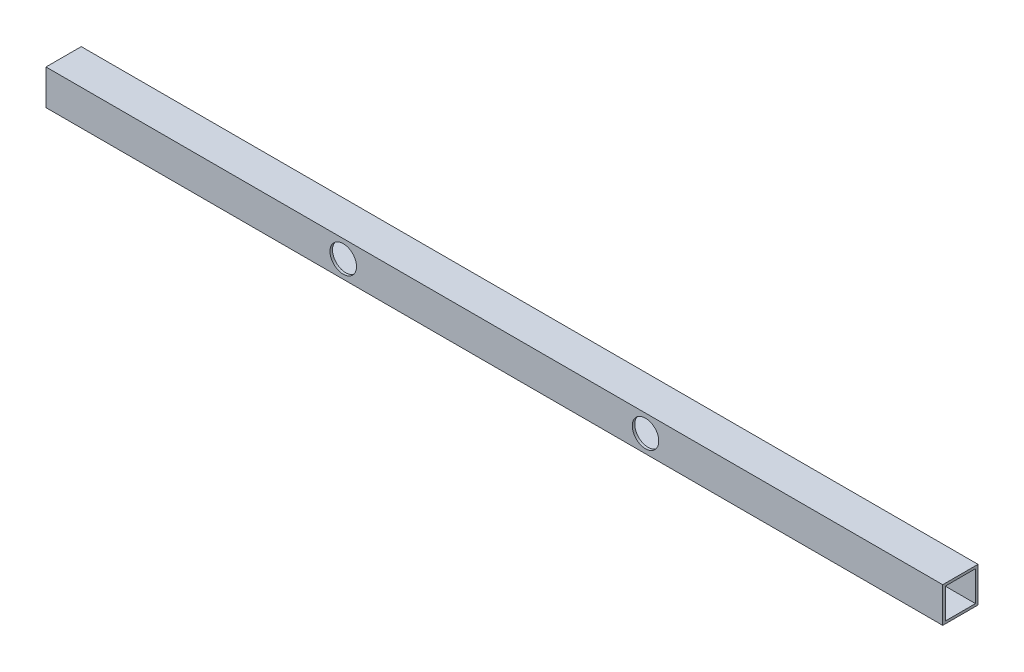
ISO-10303-21;
HEADER;
FILE_DESCRIPTION(('STEP AP214'),'2;1');
FILE_NAME('part.step','',(''),(''),'','','');
FILE_SCHEMA(('AUTOMOTIVE_DESIGN { 1 0 10303 214 1 1 1 1 }'));
ENDSEC;
DATA;
#1=APPLICATION_CONTEXT('core data for automotive mechanical design processes');
#2=APPLICATION_PROTOCOL_DEFINITION('international standard','automotive_design',2000,#1);
#3=PRODUCT_CONTEXT('',#1,'mechanical');
#4=PRODUCT('Part','Part','',(#3));
#5=PRODUCT_RELATED_PRODUCT_CATEGORY('part','',(#4));
#6=PRODUCT_DEFINITION_FORMATION('','',#4);
#7=PRODUCT_DEFINITION_CONTEXT('part definition',#1,'design');
#8=PRODUCT_DEFINITION('design','',#6,#7);
#9=PRODUCT_DEFINITION_SHAPE('','',#8);
#10=(LENGTH_UNIT() NAMED_UNIT(*) SI_UNIT(.MILLI.,.METRE.));
#11=(NAMED_UNIT(*) PLANE_ANGLE_UNIT() SI_UNIT($,.RADIAN.));
#12=(NAMED_UNIT(*) SI_UNIT($,.STERADIAN.) SOLID_ANGLE_UNIT());
#13=UNCERTAINTY_MEASURE_WITH_UNIT(LENGTH_MEASURE(1.E-05),#10,'distance_accuracy_value','');
#14=(GEOMETRIC_REPRESENTATION_CONTEXT(3) GLOBAL_UNCERTAINTY_ASSIGNED_CONTEXT((#13)) GLOBAL_UNIT_ASSIGNED_CONTEXT((#10,
#11,#12)) REPRESENTATION_CONTEXT('',''));
#15=CARTESIAN_POINT('',(0.,0.,0.));
#16=DIRECTION('',(0.,0.,1.));
#17=DIRECTION('',(1.,0.,0.));
#18=AXIS2_PLACEMENT_3D('',#15,#16,#17);
#19=CARTESIAN_POINT('',(-190.5,0.,-6.35));
#20=DIRECTION('',(0.,0.,-1.));
#21=DIRECTION('',(-0.999999999999997,0.,0.));
#22=AXIS2_PLACEMENT_3D('',#19,#20,#21);
#23=CYLINDRICAL_SURFACE('',#22,16.7005);
#24=CARTESIAN_POINT('',(-190.5,0.,44.45));
#25=DIRECTION('',(0.,0.,-1.));
#26=DIRECTION('',(-0.999999999999997,0.,0.));
#27=AXIS2_PLACEMENT_3D('',#24,#25,#26);
#28=CIRCLE('',#27,16.7005);
#29=CARTESIAN_POINT('',(-207.2005,0.,44.45));
#30=VERTEX_POINT('',#29);
#31=EDGE_CURVE('E130',#30,#30,#28,.T.);
#32=ORIENTED_EDGE('',*,*,#31,.F.);
#33=EDGE_LOOP('',(#32));
#34=FACE_BOUND('',#33,.T.);
#35=CARTESIAN_POINT('',(-190.5,0.,41.275));
#36=DIRECTION('',(0.,0.,-1.));
#37=DIRECTION('',(-0.999999999999997,0.,0.));
#38=AXIS2_PLACEMENT_3D('',#35,#36,#37);
#39=CIRCLE('',#38,16.7005);
#40=CARTESIAN_POINT('',(-207.2005,0.,41.275));
#41=VERTEX_POINT('',#40);
#42=EDGE_CURVE('E17',#41,#41,#39,.T.);
#43=ORIENTED_EDGE('',*,*,#42,.T.);
#44=EDGE_LOOP('',(#43));
#45=FACE_BOUND('',#44,.T.);
#46=ADVANCED_FACE('F14',(#34,#45),#23,.F.);
#47=CARTESIAN_POINT('',(190.499999999999,-1.22124532708767E-12,-6.35000000000008));
#48=DIRECTION('',(0.,0.,-1.));
#49=DIRECTION('',(-0.999999999999997,0.,0.));
#50=AXIS2_PLACEMENT_3D('',#47,#48,#49);
#51=CYLINDRICAL_SURFACE('',#50,16.7005);
#52=CARTESIAN_POINT('',(190.499999999999,-1.22124532708767E-12,44.4499999999999));
#53=DIRECTION('',(0.,0.,-1.));
#54=DIRECTION('',(-0.999999999999997,0.,0.));
#55=AXIS2_PLACEMENT_3D('',#52,#53,#54);
#56=CIRCLE('',#55,16.7005);
#57=CARTESIAN_POINT('',(173.799499999999,-1.18787102376672E-12,44.4499999999999));
#58=VERTEX_POINT('',#57);
#59=EDGE_CURVE('E125',#58,#58,#56,.T.);
#60=ORIENTED_EDGE('',*,*,#59,.F.);
#61=EDGE_LOOP('',(#60));
#62=FACE_BOUND('',#61,.T.);
#63=CARTESIAN_POINT('',(190.499999999999,-1.22124532708767E-12,41.2749999999999));
#64=DIRECTION('',(0.,0.,-1.));
#65=DIRECTION('',(-0.999999999999997,0.,0.));
#66=AXIS2_PLACEMENT_3D('',#63,#64,#65);
#67=CIRCLE('',#66,16.7005);
#68=CARTESIAN_POINT('',(173.799499999999,-1.18787102376672E-12,41.2749999999999));
#69=VERTEX_POINT('',#68);
#70=EDGE_CURVE('E113',#69,#69,#67,.T.);
#71=ORIENTED_EDGE('',*,*,#70,.T.);
#72=EDGE_LOOP('',(#71));
#73=FACE_BOUND('',#72,.T.);
#74=ADVANCED_FACE('F141',(#62,#73),#51,.F.);
#75=CARTESIAN_POINT('',(565.151999999997,-1.22124532708767E-12,3.175));
#76=DIRECTION('',(0.,0.,1.));
#77=DIRECTION('',(0.,-1.,0.));
#78=AXIS2_PLACEMENT_3D('',#75,#76,#77);
#79=PLANE('',#78);
#80=CARTESIAN_POINT('',(190.499999999999,-1.22124532708767E-12,3.17499999999991));
#81=DIRECTION('',(0.,0.,-1.));
#82=DIRECTION('',(-0.999999999999997,0.,0.));
#83=AXIS2_PLACEMENT_3D('',#80,#81,#82);
#84=CIRCLE('',#83,16.7005);
#85=CARTESIAN_POINT('',(173.799499999999,-1.18787102376672E-12,3.17499999999991));
#86=VERTEX_POINT('',#85);
#87=EDGE_CURVE('E108',#86,#86,#84,.T.);
#88=ORIENTED_EDGE('',*,*,#87,.T.);
#89=EDGE_LOOP('',(#88));
#90=FACE_BOUND('',#89,.T.);
#91=DIRECTION('',(0.,1.,0.));
#92=VECTOR('',#91,1.);
#93=CARTESIAN_POINT('',(-565.149999999997,1.33226762955019E-12,3.175));
#94=LINE('',#93,#92);
#95=CARTESIAN_POINT('',(-565.149999999997,19.0500000000013,3.175));
#96=VERTEX_POINT('',#95);
#97=CARTESIAN_POINT('',(-565.149999999997,-19.0499999999987,3.175));
#98=VERTEX_POINT('',#97);
#99=EDGE_CURVE('E101',#96,#98,#94,.F.);
#100=ORIENTED_EDGE('',*,*,#99,.T.);
#101=DIRECTION('',(0.999999999999997,0.,0.));
#102=VECTOR('',#101,1.);
#103=CARTESIAN_POINT('',(565.151999999998,-19.0500000000012,3.175));
#104=LINE('',#103,#102);
#105=CARTESIAN_POINT('',(565.149999999998,-19.0500000000012,3.175));
#106=VERTEX_POINT('',#105);
#107=EDGE_CURVE('E115',#106,#98,#104,.F.);
#108=ORIENTED_EDGE('',*,*,#107,.F.);
#109=DIRECTION('',(0.,1.,0.));
#110=VECTOR('',#109,1.);
#111=CARTESIAN_POINT('',(565.149999999997,-1.22124532708767E-12,3.175));
#112=LINE('',#111,#110);
#113=CARTESIAN_POINT('',(565.149999999997,19.0499999999988,3.175));
#114=VERTEX_POINT('',#113);
#115=EDGE_CURVE('E203',#114,#106,#112,.F.);
#116=ORIENTED_EDGE('',*,*,#115,.F.);
#117=DIRECTION('',(0.999999999999997,0.,0.));
#118=VECTOR('',#117,1.);
#119=CARTESIAN_POINT('',(565.151999999997,19.0499999999988,3.175));
#120=LINE('',#119,#118);
#121=EDGE_CURVE('E91',#114,#96,#120,.F.);
#122=ORIENTED_EDGE('',*,*,#121,.T.);
#123=EDGE_LOOP('',(#100,#108,#116,#122));
#124=FACE_BOUND('',#123,.T.);
#125=CARTESIAN_POINT('',(-190.5,0.,3.175));
#126=DIRECTION('',(0.,0.,-1.));
#127=DIRECTION('',(-0.999999999999997,0.,0.));
#128=AXIS2_PLACEMENT_3D('',#125,#126,#127);
#129=CIRCLE('',#128,16.7005);
#130=CARTESIAN_POINT('',(-207.2005,0.,3.175));
#131=VERTEX_POINT('',#130);
#132=EDGE_CURVE('E90',#131,#131,#129,.T.);
#133=ORIENTED_EDGE('',*,*,#132,.T.);
#134=EDGE_LOOP('',(#133));
#135=FACE_BOUND('',#134,.T.);
#136=ADVANCED_FACE('F153',(#90,#124,#135),#79,.T.);
#137=CARTESIAN_POINT('',(565.151999999998,-19.0500000000012,22.225));
#138=DIRECTION('',(0.,1.,0.));
#139=DIRECTION('',(0.,0.,1.));
#140=AXIS2_PLACEMENT_3D('',#137,#138,#139);
#141=PLANE('',#140);
#142=DIRECTION('',(0.,0.,-1.));
#143=VECTOR('',#142,1.);
#144=CARTESIAN_POINT('',(-565.149999999997,-19.0499999999987,44.4499999999999));
#145=LINE('',#144,#143);
#146=CARTESIAN_POINT('',(-565.149999999997,-19.0499999999987,41.2749999999999));
#147=VERTEX_POINT('',#146);
#148=EDGE_CURVE('E134',#98,#147,#145,.F.);
#149=ORIENTED_EDGE('',*,*,#148,.T.);
#150=DIRECTION('',(0.999999999999997,0.,0.));
#151=VECTOR('',#150,1.);
#152=CARTESIAN_POINT('',(565.151999999998,-19.0500000000012,41.275));
#153=LINE('',#152,#151);
#154=CARTESIAN_POINT('',(565.149999999998,-19.0500000000012,41.275));
#155=VERTEX_POINT('',#154);
#156=EDGE_CURVE('E77',#147,#155,#153,.T.);
#157=ORIENTED_EDGE('',*,*,#156,.T.);
#158=DIRECTION('',(0.,0.,-1.));
#159=VECTOR('',#158,1.);
#160=CARTESIAN_POINT('',(565.149999999998,-19.0500000000012,44.45));
#161=LINE('',#160,#159);
#162=EDGE_CURVE('E205',#106,#155,#161,.F.);
#163=ORIENTED_EDGE('',*,*,#162,.F.);
#164=ORIENTED_EDGE('',*,*,#107,.T.);
#165=EDGE_LOOP('',(#149,#157,#163,#164));
#166=FACE_BOUND('',#165,.T.);
#167=ADVANCED_FACE('F144',(#166),#141,.T.);
#168=CARTESIAN_POINT('',(565.151999999997,-1.22124532708767E-12,41.275));
#169=DIRECTION('',(0.,0.,1.));
#170=DIRECTION('',(0.,-1.,0.));
#171=AXIS2_PLACEMENT_3D('',#168,#169,#170);
#172=PLANE('',#171);
#173=ORIENTED_EDGE('',*,*,#70,.F.);
#174=EDGE_LOOP('',(#173));
#175=FACE_BOUND('',#174,.T.);
#176=DIRECTION('',(0.,1.,0.));
#177=VECTOR('',#176,1.);
#178=CARTESIAN_POINT('',(-565.149999999997,1.33226762955019E-12,41.275));
#179=LINE('',#178,#177);
#180=CARTESIAN_POINT('',(-565.149999999997,19.0500000000013,41.275));
#181=VERTEX_POINT('',#180);
#182=EDGE_CURVE('E98',#147,#181,#179,.T.);
#183=ORIENTED_EDGE('',*,*,#182,.T.);
#184=DIRECTION('',(0.999999999999997,0.,0.));
#185=VECTOR('',#184,1.);
#186=CARTESIAN_POINT('',(565.151999999997,19.0499999999988,41.275));
#187=LINE('',#186,#185);
#188=CARTESIAN_POINT('',(565.149999999997,19.0499999999988,41.275));
#189=VERTEX_POINT('',#188);
#190=EDGE_CURVE('E84',#181,#189,#187,.T.);
#191=ORIENTED_EDGE('',*,*,#190,.T.);
#192=DIRECTION('',(0.,1.,0.));
#193=VECTOR('',#192,1.);
#194=CARTESIAN_POINT('',(565.149999999997,-1.22124532708767E-12,41.275));
#195=LINE('',#194,#193);
#196=EDGE_CURVE('E216',#155,#189,#195,.T.);
#197=ORIENTED_EDGE('',*,*,#196,.F.);
#198=ORIENTED_EDGE('',*,*,#156,.F.);
#199=EDGE_LOOP('',(#183,#191,#197,#198));
#200=FACE_BOUND('',#199,.T.);
#201=ORIENTED_EDGE('',*,*,#42,.F.);
#202=EDGE_LOOP('',(#201));
#203=FACE_BOUND('',#202,.T.);
#204=ADVANCED_FACE('F103',(#175,#200,#203),#172,.F.);
#205=CARTESIAN_POINT('',(565.151999999997,19.0499999999988,22.225));
#206=DIRECTION('',(0.,1.,0.));
#207=DIRECTION('',(0.,0.,1.));
#208=AXIS2_PLACEMENT_3D('',#205,#206,#207);
#209=PLANE('',#208);
#210=DIRECTION('',(0.,0.,-1.));
#211=VECTOR('',#210,1.);
#212=CARTESIAN_POINT('',(-565.149999999997,19.0500000000013,44.45));
#213=LINE('',#212,#211);
#214=EDGE_CURVE('E87',#181,#96,#213,.T.);
#215=ORIENTED_EDGE('',*,*,#214,.T.);
#216=ORIENTED_EDGE('',*,*,#121,.F.);
#217=DIRECTION('',(0.,0.,-1.));
#218=VECTOR('',#217,1.);
#219=CARTESIAN_POINT('',(565.149999999997,19.0499999999988,44.45));
#220=LINE('',#219,#218);
#221=EDGE_CURVE('E89',#189,#114,#220,.T.);
#222=ORIENTED_EDGE('',*,*,#221,.F.);
#223=ORIENTED_EDGE('',*,*,#190,.F.);
#224=EDGE_LOOP('',(#215,#216,#222,#223));
#225=FACE_BOUND('',#224,.T.);
#226=ADVANCED_FACE('F86',(#225),#209,.F.);
#227=CARTESIAN_POINT('',(0.,22.2249999999999,44.45));
#228=DIRECTION('',(0.,1.,0.));
#229=DIRECTION('',(0.,0.,1.));
#230=AXIS2_PLACEMENT_3D('',#227,#228,#229);
#231=PLANE('',#230);
#232=DIRECTION('',(0.999999999999997,0.,0.));
#233=VECTOR('',#232,1.);
#234=CARTESIAN_POINT('',(0.,22.2249999999999,44.45));
#235=LINE('',#234,#233);
#236=CARTESIAN_POINT('',(565.149999999997,22.2249999999987,44.4499999999999));
#237=VERTEX_POINT('',#236);
#238=CARTESIAN_POINT('',(-565.149999999997,22.2250000000013,44.45));
#239=VERTEX_POINT('',#238);
#240=EDGE_CURVE('E133',#237,#239,#235,.F.);
#241=ORIENTED_EDGE('',*,*,#240,.F.);
#242=DIRECTION('',(0.,0.,-1.));
#243=VECTOR('',#242,1.);
#244=CARTESIAN_POINT('',(565.149999999997,22.2249999999987,44.4499999999999));
#245=LINE('',#244,#243);
#246=CARTESIAN_POINT('',(565.149999999997,22.2249999999987,0.));
#247=VERTEX_POINT('',#246);
#248=EDGE_CURVE('E128',#247,#237,#245,.F.);
#249=ORIENTED_EDGE('',*,*,#248,.F.);
#250=DIRECTION('',(0.999999999999997,0.,0.));
#251=VECTOR('',#250,1.);
#252=CARTESIAN_POINT('',(0.,22.2249999999999,0.));
#253=LINE('',#252,#251);
#254=CARTESIAN_POINT('',(-565.149999999997,22.2250000000013,0.));
#255=VERTEX_POINT('',#254);
#256=EDGE_CURVE('E124',#247,#255,#253,.F.);
#257=ORIENTED_EDGE('',*,*,#256,.T.);
#258=DIRECTION('',(0.,0.,-1.));
#259=VECTOR('',#258,1.);
#260=CARTESIAN_POINT('',(-565.149999999997,22.2250000000013,44.45));
#261=LINE('',#260,#259);
#262=EDGE_CURVE('E105',#255,#239,#261,.F.);
#263=ORIENTED_EDGE('',*,*,#262,.T.);
#264=EDGE_LOOP('',(#241,#249,#257,#263));
#265=FACE_BOUND('',#264,.T.);
#266=ADVANCED_FACE('F151',(#265),#231,.T.);
#267=CARTESIAN_POINT('',(-190.5,0.,-6.35));
#268=DIRECTION('',(0.,0.,-1.));
#269=DIRECTION('',(-0.999999999999997,0.,0.));
#270=AXIS2_PLACEMENT_3D('',#267,#268,#269);
#271=CYLINDRICAL_SURFACE('',#270,16.7005);
#272=ORIENTED_EDGE('',*,*,#132,.F.);
#273=EDGE_LOOP('',(#272));
#274=FACE_BOUND('',#273,.T.);
#275=CARTESIAN_POINT('',(-190.5,0.,0.));
#276=DIRECTION('',(0.,0.,-1.));
#277=DIRECTION('',(-0.999999999999997,0.,0.));
#278=AXIS2_PLACEMENT_3D('',#275,#276,#277);
#279=CIRCLE('',#278,16.7005);
#280=CARTESIAN_POINT('',(-207.2005,0.,0.));
#281=VERTEX_POINT('',#280);
#282=EDGE_CURVE('E121',#281,#281,#279,.T.);
#283=ORIENTED_EDGE('',*,*,#282,.T.);
#284=EDGE_LOOP('',(#283));
#285=FACE_BOUND('',#284,.T.);
#286=ADVANCED_FACE('F181',(#274,#285),#271,.F.);
#287=CARTESIAN_POINT('',(190.499999999999,-1.22124532708767E-12,-6.35000000000008));
#288=DIRECTION('',(0.,0.,-1.));
#289=DIRECTION('',(-0.999999999999997,0.,0.));
#290=AXIS2_PLACEMENT_3D('',#287,#288,#289);
#291=CYLINDRICAL_SURFACE('',#290,16.7005);
#292=ORIENTED_EDGE('',*,*,#87,.F.);
#293=EDGE_LOOP('',(#292));
#294=FACE_BOUND('',#293,.T.);
#295=CARTESIAN_POINT('',(190.499999999999,-1.22124532708767E-12,0.));
#296=DIRECTION('',(0.,0.,-1.));
#297=DIRECTION('',(-0.999999999999997,0.,0.));
#298=AXIS2_PLACEMENT_3D('',#295,#296,#297);
#299=CIRCLE('',#298,16.7005);
#300=CARTESIAN_POINT('',(173.799499999999,-1.18787102376672E-12,0.));
#301=VERTEX_POINT('',#300);
#302=EDGE_CURVE('E117',#301,#301,#299,.T.);
#303=ORIENTED_EDGE('',*,*,#302,.T.);
#304=EDGE_LOOP('',(#303));
#305=FACE_BOUND('',#304,.T.);
#306=ADVANCED_FACE('F178',(#294,#305),#291,.F.);
#307=CARTESIAN_POINT('',(-565.149999999997,1.33226762955019E-12,44.45));
#308=DIRECTION('',(0.999999999999997,0.,0.));
#309=DIRECTION('',(0.,0.,-1.));
#310=AXIS2_PLACEMENT_3D('',#307,#308,#309);
#311=PLANE('',#310);
#312=ORIENTED_EDGE('',*,*,#99,.F.);
#313=ORIENTED_EDGE('',*,*,#214,.F.);
#314=ORIENTED_EDGE('',*,*,#182,.F.);
#315=ORIENTED_EDGE('',*,*,#148,.F.);
#316=EDGE_LOOP('',(#312,#313,#314,#315));
#317=FACE_BOUND('',#316,.T.);
#318=DIRECTION('',(0.,0.,1.));
#319=VECTOR('',#318,1.);
#320=CARTESIAN_POINT('',(-565.149999999997,-22.2249999999986,44.45));
#321=LINE('',#320,#319);
#322=CARTESIAN_POINT('',(-565.149999999997,-22.2249999999986,0.));
#323=VERTEX_POINT('',#322);
#324=CARTESIAN_POINT('',(-565.149999999997,-22.2249999999986,44.45));
#325=VERTEX_POINT('',#324);
#326=EDGE_CURVE('E120',#323,#325,#321,.T.);
#327=ORIENTED_EDGE('',*,*,#326,.T.);
#328=DIRECTION('',(0.,1.,0.));
#329=VECTOR('',#328,1.);
#330=CARTESIAN_POINT('',(-565.149999999997,1.33226762955019E-12,44.45));
#331=LINE('',#330,#329);
#332=EDGE_CURVE('E129',#239,#325,#331,.F.);
#333=ORIENTED_EDGE('',*,*,#332,.F.);
#334=ORIENTED_EDGE('',*,*,#262,.F.);
#335=DIRECTION('',(0.,1.,0.));
#336=VECTOR('',#335,1.);
#337=CARTESIAN_POINT('',(-565.149999999997,1.33226762955019E-12,0.));
#338=LINE('',#337,#336);
#339=EDGE_CURVE('E217',#255,#323,#338,.F.);
#340=ORIENTED_EDGE('',*,*,#339,.T.);
#341=EDGE_LOOP('',(#327,#333,#334,#340));
#342=FACE_BOUND('',#341,.T.);
#343=ADVANCED_FACE('F95',(#317,#342),#311,.F.);
#344=CARTESIAN_POINT('',(0.,0.,44.45));
#345=DIRECTION('',(0.,0.,1.));
#346=DIRECTION('',(0.999999999999997,0.,0.));
#347=AXIS2_PLACEMENT_3D('',#344,#345,#346);
#348=PLANE('',#347);
#349=ORIENTED_EDGE('',*,*,#59,.T.);
#350=EDGE_LOOP('',(#349));
#351=FACE_BOUND('',#350,.T.);
#352=DIRECTION('',(0.999999999999997,0.,0.));
#353=VECTOR('',#352,1.);
#354=CARTESIAN_POINT('',(0.,-22.2249999999999,44.4499999999999));
#355=LINE('',#354,#353);
#356=CARTESIAN_POINT('',(565.149999999998,-22.2250000000012,44.45));
#357=VERTEX_POINT('',#356);
#358=EDGE_CURVE('E200',#325,#357,#355,.T.);
#359=ORIENTED_EDGE('',*,*,#358,.T.);
#360=DIRECTION('',(0.,1.,0.));
#361=VECTOR('',#360,1.);
#362=CARTESIAN_POINT('',(565.149999999997,-1.22124532708767E-12,44.45));
#363=LINE('',#362,#361);
#364=EDGE_CURVE('E197',#237,#357,#363,.F.);
#365=ORIENTED_EDGE('',*,*,#364,.F.);
#366=ORIENTED_EDGE('',*,*,#240,.T.);
#367=ORIENTED_EDGE('',*,*,#332,.T.);
#368=EDGE_LOOP('',(#359,#365,#366,#367));
#369=FACE_BOUND('',#368,.T.);
#370=ORIENTED_EDGE('',*,*,#31,.T.);
#371=EDGE_LOOP('',(#370));
#372=FACE_BOUND('',#371,.T.);
#373=ADVANCED_FACE('F171',(#351,#369,#372),#348,.T.);
#374=CARTESIAN_POINT('',(565.149999999997,-1.22124532708767E-12,44.45));
#375=DIRECTION('',(0.999999999999997,0.,0.));
#376=DIRECTION('',(0.,0.,-1.));
#377=AXIS2_PLACEMENT_3D('',#374,#375,#376);
#378=PLANE('',#377);
#379=ORIENTED_EDGE('',*,*,#196,.T.);
#380=ORIENTED_EDGE('',*,*,#221,.T.);
#381=ORIENTED_EDGE('',*,*,#115,.T.);
#382=ORIENTED_EDGE('',*,*,#162,.T.);
#383=EDGE_LOOP('',(#379,#380,#381,#382));
#384=FACE_BOUND('',#383,.T.);
#385=ORIENTED_EDGE('',*,*,#364,.T.);
#386=DIRECTION('',(0.,0.,1.));
#387=VECTOR('',#386,1.);
#388=CARTESIAN_POINT('',(565.149999999998,-22.2250000000012,44.45));
#389=LINE('',#388,#387);
#390=CARTESIAN_POINT('',(565.149999999998,-22.2250000000012,0.));
#391=VERTEX_POINT('',#390);
#392=EDGE_CURVE('E23',#357,#391,#389,.F.);
#393=ORIENTED_EDGE('',*,*,#392,.T.);
#394=DIRECTION('',(0.,1.,0.));
#395=VECTOR('',#394,1.);
#396=CARTESIAN_POINT('',(565.149999999997,-1.22124532708767E-12,0.));
#397=LINE('',#396,#395);
#398=EDGE_CURVE('E31',#391,#247,#397,.T.);
#399=ORIENTED_EDGE('',*,*,#398,.T.);
#400=ORIENTED_EDGE('',*,*,#248,.T.);
#401=EDGE_LOOP('',(#385,#393,#399,#400));
#402=FACE_BOUND('',#401,.T.);
#403=ADVANCED_FACE('F164',(#384,#402),#378,.T.);
#404=CARTESIAN_POINT('',(0.,0.,0.));
#405=DIRECTION('',(0.,0.,1.));
#406=DIRECTION('',(0.999999999999997,0.,0.));
#407=AXIS2_PLACEMENT_3D('',#404,#405,#406);
#408=PLANE('',#407);
#409=ORIENTED_EDGE('',*,*,#302,.F.);
#410=EDGE_LOOP('',(#409));
#411=FACE_BOUND('',#410,.T.);
#412=ORIENTED_EDGE('',*,*,#282,.F.);
#413=EDGE_LOOP('',(#412));
#414=FACE_BOUND('',#413,.T.);
#415=ORIENTED_EDGE('',*,*,#398,.F.);
#416=DIRECTION('',(0.999999999999997,0.,0.));
#417=VECTOR('',#416,1.);
#418=CARTESIAN_POINT('',(0.,-22.2249999999999,0.));
#419=LINE('',#418,#417);
#420=EDGE_CURVE('E9',#391,#323,#419,.F.);
#421=ORIENTED_EDGE('',*,*,#420,.T.);
#422=ORIENTED_EDGE('',*,*,#339,.F.);
#423=ORIENTED_EDGE('',*,*,#256,.F.);
#424=EDGE_LOOP('',(#415,#421,#422,#423));
#425=FACE_BOUND('',#424,.T.);
#426=ADVANCED_FACE('F158',(#411,#414,#425),#408,.F.);
#427=CARTESIAN_POINT('',(0.,-22.2249999999999,44.4499999999999));
#428=DIRECTION('',(0.,1.,0.));
#429=DIRECTION('',(0.,0.,1.));
#430=AXIS2_PLACEMENT_3D('',#427,#428,#429);
#431=PLANE('',#430);
#432=ORIENTED_EDGE('',*,*,#392,.F.);
#433=ORIENTED_EDGE('',*,*,#358,.F.);
#434=ORIENTED_EDGE('',*,*,#326,.F.);
#435=ORIENTED_EDGE('',*,*,#420,.F.);
#436=EDGE_LOOP('',(#432,#433,#434,#435));
#437=FACE_BOUND('',#436,.T.);
#438=ADVANCED_FACE('F156',(#437),#431,.F.);
#439=CLOSED_SHELL('',(#46,#74,#136,#167,#204,#226,#266,#286,#306,#343,#373,#403,#426,#438));
#440=MANIFOLD_SOLID_BREP('B1',#439);
#441=ADVANCED_BREP_SHAPE_REPRESENTATION('',(#18,#440),#14);
#442=SHAPE_DEFINITION_REPRESENTATION(#9,#441);
ENDSEC;
END-ISO-10303-21;
